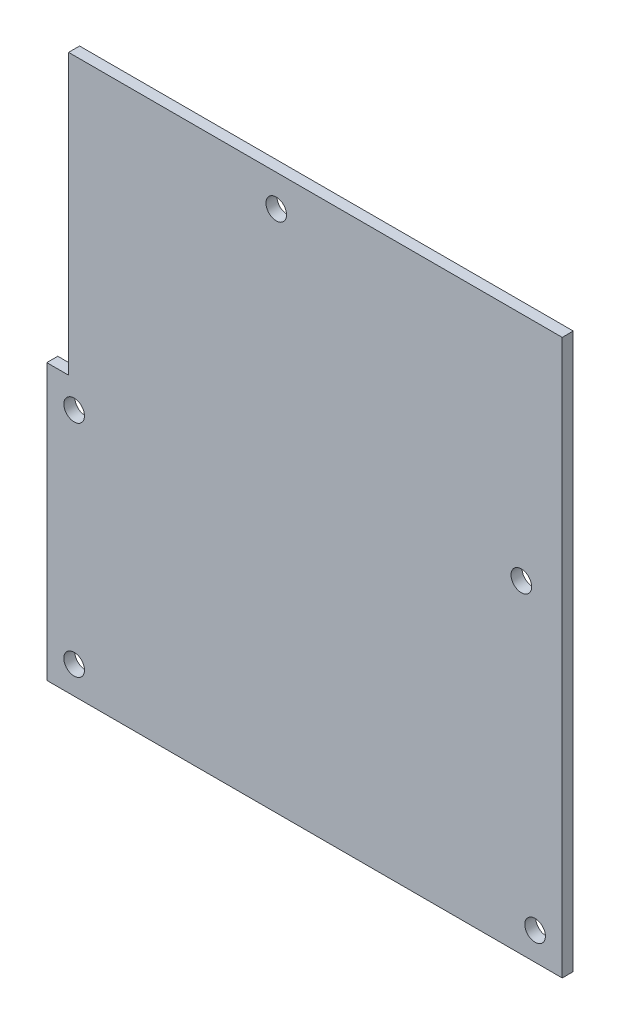
ISO-10303-21;
HEADER;
FILE_DESCRIPTION(('STEP AP214'),'2;1');
FILE_NAME('part.step','',(''),(''),'','','');
FILE_SCHEMA(('AUTOMOTIVE_DESIGN { 1 0 10303 214 1 1 1 1 }'));
ENDSEC;
DATA;
#1=APPLICATION_CONTEXT('core data for automotive mechanical design processes');
#2=APPLICATION_PROTOCOL_DEFINITION('international standard','automotive_design',2000,#1);
#3=PRODUCT_CONTEXT('',#1,'mechanical');
#4=PRODUCT('Part','Part','',(#3));
#5=PRODUCT_RELATED_PRODUCT_CATEGORY('part','',(#4));
#6=PRODUCT_DEFINITION_FORMATION('','',#4);
#7=PRODUCT_DEFINITION_CONTEXT('part definition',#1,'design');
#8=PRODUCT_DEFINITION('design','',#6,#7);
#9=PRODUCT_DEFINITION_SHAPE('','',#8);
#10=(LENGTH_UNIT() NAMED_UNIT(*) SI_UNIT(.MILLI.,.METRE.));
#11=(NAMED_UNIT(*) PLANE_ANGLE_UNIT() SI_UNIT($,.RADIAN.));
#12=(NAMED_UNIT(*) SI_UNIT($,.STERADIAN.) SOLID_ANGLE_UNIT());
#13=UNCERTAINTY_MEASURE_WITH_UNIT(LENGTH_MEASURE(1.E-05),#10,'distance_accuracy_value','');
#14=(GEOMETRIC_REPRESENTATION_CONTEXT(3) GLOBAL_UNCERTAINTY_ASSIGNED_CONTEXT((#13)) GLOBAL_UNIT_ASSIGNED_CONTEXT((#10,
#11,#12)) REPRESENTATION_CONTEXT('',''));
#15=CARTESIAN_POINT('',(0.,0.,0.));
#16=DIRECTION('',(0.,0.,1.));
#17=DIRECTION('',(1.,0.,0.));
#18=AXIS2_PLACEMENT_3D('',#15,#16,#17);
#19=CARTESIAN_POINT('',(0.,80.645,1.6002));
#20=DIRECTION('',(0.,-1.,0.));
#21=DIRECTION('',(0.,0.,-1.));
#22=AXIS2_PLACEMENT_3D('',#19,#20,#21);
#23=PLANE('',#22);
#24=DIRECTION('',(-1.,0.,0.));
#25=VECTOR('',#24,1.);
#26=CARTESIAN_POINT('',(0.,80.645,0.));
#27=LINE('',#26,#25);
#28=CARTESIAN_POINT('',(74.93,80.645,0.));
#29=VERTEX_POINT('',#28);
#30=CARTESIAN_POINT('',(3.175,80.645,0.));
#31=VERTEX_POINT('',#30);
#32=EDGE_CURVE('E132',#29,#31,#27,.T.);
#33=ORIENTED_EDGE('',*,*,#32,.T.);
#34=DIRECTION('',(0.,0.,-1.));
#35=VECTOR('',#34,1.);
#36=CARTESIAN_POINT('',(3.175,80.645,1.6002));
#37=LINE('',#36,#35);
#38=CARTESIAN_POINT('',(3.175,80.645,1.6002));
#39=VERTEX_POINT('',#38);
#40=EDGE_CURVE('E11',#39,#31,#37,.T.);
#41=ORIENTED_EDGE('',*,*,#40,.F.);
#42=DIRECTION('',(-1.,0.,0.));
#43=VECTOR('',#42,1.);
#44=CARTESIAN_POINT('',(0.,80.645,1.6002));
#45=LINE('',#44,#43);
#46=CARTESIAN_POINT('',(74.93,80.645,1.6002));
#47=VERTEX_POINT('',#46);
#48=EDGE_CURVE('E157',#47,#39,#45,.T.);
#49=ORIENTED_EDGE('',*,*,#48,.F.);
#50=DIRECTION('',(0.,0.,-1.));
#51=VECTOR('',#50,1.);
#52=CARTESIAN_POINT('',(74.93,80.645,1.6002));
#53=LINE('',#52,#51);
#54=EDGE_CURVE('E116',#47,#29,#53,.T.);
#55=ORIENTED_EDGE('',*,*,#54,.T.);
#56=EDGE_LOOP('',(#33,#41,#49,#55));
#57=FACE_BOUND('',#56,.T.);
#58=ADVANCED_FACE('F32',(#57),#23,.F.);
#59=CARTESIAN_POINT('',(3.175,0.,1.6002));
#60=DIRECTION('',(1.,0.,0.));
#61=DIRECTION('',(0.,0.,-1.));
#62=AXIS2_PLACEMENT_3D('',#59,#60,#61);
#63=PLANE('',#62);
#64=DIRECTION('',(0.,-1.,0.));
#65=VECTOR('',#64,1.);
#66=CARTESIAN_POINT('',(3.175,0.,0.));
#67=LINE('',#66,#65);
#68=CARTESIAN_POINT('',(3.175,40.005,0.));
#69=VERTEX_POINT('',#68);
#70=EDGE_CURVE('E135',#31,#69,#67,.T.);
#71=ORIENTED_EDGE('',*,*,#70,.T.);
#72=DIRECTION('',(0.,0.,-1.));
#73=VECTOR('',#72,1.);
#74=CARTESIAN_POINT('',(3.175,40.005,1.6002));
#75=LINE('',#74,#73);
#76=CARTESIAN_POINT('',(3.175,40.005,1.6002));
#77=VERTEX_POINT('',#76);
#78=EDGE_CURVE('E41',#77,#69,#75,.T.);
#79=ORIENTED_EDGE('',*,*,#78,.F.);
#80=DIRECTION('',(0.,-1.,0.));
#81=VECTOR('',#80,1.);
#82=CARTESIAN_POINT('',(3.175,0.,1.6002));
#83=LINE('',#82,#81);
#84=EDGE_CURVE('E85',#39,#77,#83,.T.);
#85=ORIENTED_EDGE('',*,*,#84,.F.);
#86=ORIENTED_EDGE('',*,*,#40,.T.);
#87=EDGE_LOOP('',(#71,#79,#85,#86));
#88=FACE_BOUND('',#87,.T.);
#89=ADVANCED_FACE('F150',(#88),#63,.F.);
#90=CARTESIAN_POINT('',(0.,40.005,1.6002));
#91=DIRECTION('',(0.,1.,0.));
#92=DIRECTION('',(0.,0.,1.));
#93=AXIS2_PLACEMENT_3D('',#90,#91,#92);
#94=PLANE('',#93);
#95=DIRECTION('',(1.,0.,0.));
#96=VECTOR('',#95,1.);
#97=CARTESIAN_POINT('',(0.,40.005,0.));
#98=LINE('',#97,#96);
#99=CARTESIAN_POINT('',(0.,40.005,0.));
#100=VERTEX_POINT('',#99);
#101=EDGE_CURVE('E138',#100,#69,#98,.T.);
#102=ORIENTED_EDGE('',*,*,#101,.F.);
#103=DIRECTION('',(0.,0.,-1.));
#104=VECTOR('',#103,1.);
#105=CARTESIAN_POINT('',(0.,40.005,1.6002));
#106=LINE('',#105,#104);
#107=CARTESIAN_POINT('',(0.,40.005,1.6002));
#108=VERTEX_POINT('',#107);
#109=EDGE_CURVE('E101',#108,#100,#106,.T.);
#110=ORIENTED_EDGE('',*,*,#109,.F.);
#111=DIRECTION('',(1.,0.,0.));
#112=VECTOR('',#111,1.);
#113=CARTESIAN_POINT('',(0.,40.005,1.6002));
#114=LINE('',#113,#112);
#115=EDGE_CURVE('E110',#108,#77,#114,.T.);
#116=ORIENTED_EDGE('',*,*,#115,.T.);
#117=ORIENTED_EDGE('',*,*,#78,.T.);
#118=EDGE_LOOP('',(#102,#110,#116,#117));
#119=FACE_BOUND('',#118,.T.);
#120=ADVANCED_FACE('F149',(#119),#94,.T.);
#121=CARTESIAN_POINT('',(0.,0.,1.6002));
#122=DIRECTION('',(-1.,0.,0.));
#123=DIRECTION('',(0.,0.,1.));
#124=AXIS2_PLACEMENT_3D('',#121,#122,#123);
#125=PLANE('',#124);
#126=DIRECTION('',(0.,1.,0.));
#127=VECTOR('',#126,1.);
#128=CARTESIAN_POINT('',(0.,0.,0.));
#129=LINE('',#128,#127);
#130=CARTESIAN_POINT('',(0.,0.,0.));
#131=VERTEX_POINT('',#130);
#132=EDGE_CURVE('E100',#131,#100,#129,.T.);
#133=ORIENTED_EDGE('',*,*,#132,.F.);
#134=DIRECTION('',(0.,0.,-1.));
#135=VECTOR('',#134,1.);
#136=CARTESIAN_POINT('',(0.,0.,1.6002));
#137=LINE('',#136,#135);
#138=CARTESIAN_POINT('',(0.,0.,1.6002));
#139=VERTEX_POINT('',#138);
#140=EDGE_CURVE('E94',#139,#131,#137,.T.);
#141=ORIENTED_EDGE('',*,*,#140,.F.);
#142=DIRECTION('',(0.,1.,0.));
#143=VECTOR('',#142,1.);
#144=CARTESIAN_POINT('',(0.,0.,1.6002));
#145=LINE('',#144,#143);
#146=EDGE_CURVE('E98',#139,#108,#145,.T.);
#147=ORIENTED_EDGE('',*,*,#146,.T.);
#148=ORIENTED_EDGE('',*,*,#109,.T.);
#149=EDGE_LOOP('',(#133,#141,#147,#148));
#150=FACE_BOUND('',#149,.T.);
#151=ADVANCED_FACE('F96',(#150),#125,.T.);
#152=CARTESIAN_POINT('',(0.,0.,1.6002));
#153=DIRECTION('',(0.,1.,0.));
#154=DIRECTION('',(0.,0.,1.));
#155=AXIS2_PLACEMENT_3D('',#152,#153,#154);
#156=PLANE('',#155);
#157=DIRECTION('',(1.,0.,0.));
#158=VECTOR('',#157,1.);
#159=CARTESIAN_POINT('',(0.,0.,0.));
#160=LINE('',#159,#158);
#161=CARTESIAN_POINT('',(74.93,0.,0.));
#162=VERTEX_POINT('',#161);
#163=EDGE_CURVE('E71',#131,#162,#160,.T.);
#164=ORIENTED_EDGE('',*,*,#163,.T.);
#165=DIRECTION('',(0.,0.,-1.));
#166=VECTOR('',#165,1.);
#167=CARTESIAN_POINT('',(74.93,0.,1.6002));
#168=LINE('',#167,#166);
#169=CARTESIAN_POINT('',(74.93,0.,1.6002));
#170=VERTEX_POINT('',#169);
#171=EDGE_CURVE('E102',#170,#162,#168,.T.);
#172=ORIENTED_EDGE('',*,*,#171,.F.);
#173=DIRECTION('',(1.,0.,0.));
#174=VECTOR('',#173,1.);
#175=CARTESIAN_POINT('',(0.,0.,1.6002));
#176=LINE('',#175,#174);
#177=EDGE_CURVE('E104',#139,#170,#176,.T.);
#178=ORIENTED_EDGE('',*,*,#177,.F.);
#179=ORIENTED_EDGE('',*,*,#140,.T.);
#180=EDGE_LOOP('',(#164,#172,#178,#179));
#181=FACE_BOUND('',#180,.T.);
#182=ADVANCED_FACE('F105',(#181),#156,.F.);
#183=CARTESIAN_POINT('',(3.984,4.026,1.6002));
#184=DIRECTION('',(0.,0.,-1.));
#185=DIRECTION('',(-1.,0.,0.));
#186=AXIS2_PLACEMENT_3D('',#183,#184,#185);
#187=CYLINDRICAL_SURFACE('',#186,1.5);
#188=CARTESIAN_POINT('',(3.984,4.026,1.6002));
#189=DIRECTION('',(0.,0.,1.));
#190=DIRECTION('',(1.,0.,0.));
#191=AXIS2_PLACEMENT_3D('',#188,#189,#190);
#192=CIRCLE('',#191,1.5);
#193=CARTESIAN_POINT('',(5.484,4.026,1.6002));
#194=VERTEX_POINT('',#193);
#195=EDGE_CURVE('E309',#194,#194,#192,.T.);
#196=ORIENTED_EDGE('',*,*,#195,.T.);
#197=EDGE_LOOP('',(#196));
#198=FACE_BOUND('',#197,.T.);
#199=CARTESIAN_POINT('',(3.984,4.026,0.));
#200=DIRECTION('',(0.,0.,1.));
#201=DIRECTION('',(1.,0.,0.));
#202=AXIS2_PLACEMENT_3D('',#199,#200,#201);
#203=CIRCLE('',#202,1.5);
#204=CARTESIAN_POINT('',(5.484,4.026,0.));
#205=VERTEX_POINT('',#204);
#206=EDGE_CURVE('E129',#205,#205,#203,.T.);
#207=ORIENTED_EDGE('',*,*,#206,.F.);
#208=EDGE_LOOP('',(#207));
#209=FACE_BOUND('',#208,.T.);
#210=ADVANCED_FACE('F179',(#198,#209),#187,.F.);
#211=CARTESIAN_POINT('',(70.984,4.026,1.6002));
#212=DIRECTION('',(0.,0.,-1.));
#213=DIRECTION('',(-1.,0.,0.));
#214=AXIS2_PLACEMENT_3D('',#211,#212,#213);
#215=CYLINDRICAL_SURFACE('',#214,1.5);
#216=CARTESIAN_POINT('',(70.984,4.026,1.6002));
#217=DIRECTION('',(0.,0.,1.));
#218=DIRECTION('',(1.,0.,0.));
#219=AXIS2_PLACEMENT_3D('',#216,#217,#218);
#220=CIRCLE('',#219,1.5);
#221=CARTESIAN_POINT('',(72.484,4.026,1.6002));
#222=VERTEX_POINT('',#221);
#223=EDGE_CURVE('E302',#222,#222,#220,.T.);
#224=ORIENTED_EDGE('',*,*,#223,.T.);
#225=EDGE_LOOP('',(#224));
#226=FACE_BOUND('',#225,.T.);
#227=CARTESIAN_POINT('',(70.984,4.026,0.));
#228=DIRECTION('',(0.,0.,1.));
#229=DIRECTION('',(1.,0.,0.));
#230=AXIS2_PLACEMENT_3D('',#227,#228,#229);
#231=CIRCLE('',#230,1.5);
#232=CARTESIAN_POINT('',(72.484,4.026,0.));
#233=VERTEX_POINT('',#232);
#234=EDGE_CURVE('E126',#233,#233,#231,.T.);
#235=ORIENTED_EDGE('',*,*,#234,.F.);
#236=EDGE_LOOP('',(#235));
#237=FACE_BOUND('',#236,.T.);
#238=ADVANCED_FACE('F182',(#226,#237),#215,.F.);
#239=CARTESIAN_POINT('',(3.984,36.026,1.6002));
#240=DIRECTION('',(0.,0.,-1.));
#241=DIRECTION('',(-1.,0.,0.));
#242=AXIS2_PLACEMENT_3D('',#239,#240,#241);
#243=CYLINDRICAL_SURFACE('',#242,1.5);
#244=CARTESIAN_POINT('',(3.984,36.026,1.6002));
#245=DIRECTION('',(0.,0.,1.));
#246=DIRECTION('',(1.,0.,0.));
#247=AXIS2_PLACEMENT_3D('',#244,#245,#246);
#248=CIRCLE('',#247,1.5);
#249=CARTESIAN_POINT('',(5.484,36.026,1.6002));
#250=VERTEX_POINT('',#249);
#251=EDGE_CURVE('E299',#250,#250,#248,.T.);
#252=ORIENTED_EDGE('',*,*,#251,.T.);
#253=EDGE_LOOP('',(#252));
#254=FACE_BOUND('',#253,.T.);
#255=CARTESIAN_POINT('',(3.984,36.026,0.));
#256=DIRECTION('',(0.,0.,1.));
#257=DIRECTION('',(1.,0.,0.));
#258=AXIS2_PLACEMENT_3D('',#255,#256,#257);
#259=CIRCLE('',#258,1.5);
#260=CARTESIAN_POINT('',(5.484,36.026,0.));
#261=VERTEX_POINT('',#260);
#262=EDGE_CURVE('E123',#261,#261,#259,.T.);
#263=ORIENTED_EDGE('',*,*,#262,.F.);
#264=EDGE_LOOP('',(#263));
#265=FACE_BOUND('',#264,.T.);
#266=ADVANCED_FACE('F186',(#254,#265),#243,.F.);
#267=CARTESIAN_POINT('',(33.3595,76.026,1.6002));
#268=DIRECTION('',(0.,0.,-1.));
#269=DIRECTION('',(-1.,0.,0.));
#270=AXIS2_PLACEMENT_3D('',#267,#268,#269);
#271=CYLINDRICAL_SURFACE('',#270,1.5);
#272=CARTESIAN_POINT('',(33.3595,76.026,1.6002));
#273=DIRECTION('',(0.,0.,1.));
#274=DIRECTION('',(1.,0.,0.));
#275=AXIS2_PLACEMENT_3D('',#272,#273,#274);
#276=CIRCLE('',#275,1.5);
#277=CARTESIAN_POINT('',(34.8595,76.026,1.6002));
#278=VERTEX_POINT('',#277);
#279=EDGE_CURVE('E197',#278,#278,#276,.T.);
#280=ORIENTED_EDGE('',*,*,#279,.T.);
#281=EDGE_LOOP('',(#280));
#282=FACE_BOUND('',#281,.T.);
#283=CARTESIAN_POINT('',(33.3595,76.026,0.));
#284=DIRECTION('',(0.,0.,1.));
#285=DIRECTION('',(1.,0.,0.));
#286=AXIS2_PLACEMENT_3D('',#283,#284,#285);
#287=CIRCLE('',#286,1.5);
#288=CARTESIAN_POINT('',(34.8595,76.026,0.));
#289=VERTEX_POINT('',#288);
#290=EDGE_CURVE('E120',#289,#289,#287,.T.);
#291=ORIENTED_EDGE('',*,*,#290,.F.);
#292=EDGE_LOOP('',(#291));
#293=FACE_BOUND('',#292,.T.);
#294=ADVANCED_FACE('F167',(#282,#293),#271,.F.);
#295=CARTESIAN_POINT('',(68.984,47.026,1.6002));
#296=DIRECTION('',(0.,0.,-1.));
#297=DIRECTION('',(-1.,0.,0.));
#298=AXIS2_PLACEMENT_3D('',#295,#296,#297);
#299=CYLINDRICAL_SURFACE('',#298,1.5);
#300=CARTESIAN_POINT('',(68.984,47.026,1.6002));
#301=DIRECTION('',(0.,0.,1.));
#302=DIRECTION('',(1.,0.,0.));
#303=AXIS2_PLACEMENT_3D('',#300,#301,#302);
#304=CIRCLE('',#303,1.5);
#305=CARTESIAN_POINT('',(70.484,47.026,1.6002));
#306=VERTEX_POINT('',#305);
#307=EDGE_CURVE('E144',#306,#306,#304,.T.);
#308=ORIENTED_EDGE('',*,*,#307,.T.);
#309=EDGE_LOOP('',(#308));
#310=FACE_BOUND('',#309,.T.);
#311=CARTESIAN_POINT('',(68.984,47.026,0.));
#312=DIRECTION('',(0.,0.,1.));
#313=DIRECTION('',(1.,0.,0.));
#314=AXIS2_PLACEMENT_3D('',#311,#312,#313);
#315=CIRCLE('',#314,1.5);
#316=CARTESIAN_POINT('',(70.484,47.026,0.));
#317=VERTEX_POINT('',#316);
#318=EDGE_CURVE('E117',#317,#317,#315,.T.);
#319=ORIENTED_EDGE('',*,*,#318,.F.);
#320=EDGE_LOOP('',(#319));
#321=FACE_BOUND('',#320,.T.);
#322=ADVANCED_FACE('F34',(#310,#321),#299,.F.);
#323=CARTESIAN_POINT('',(74.93,0.,1.6002));
#324=DIRECTION('',(-1.,0.,0.));
#325=DIRECTION('',(0.,0.,1.));
#326=AXIS2_PLACEMENT_3D('',#323,#324,#325);
#327=PLANE('',#326);
#328=DIRECTION('',(0.,1.,0.));
#329=VECTOR('',#328,1.);
#330=CARTESIAN_POINT('',(74.93,0.,0.));
#331=LINE('',#330,#329);
#332=EDGE_CURVE('E77',#162,#29,#331,.T.);
#333=ORIENTED_EDGE('',*,*,#332,.T.);
#334=ORIENTED_EDGE('',*,*,#54,.F.);
#335=DIRECTION('',(0.,1.,0.));
#336=VECTOR('',#335,1.);
#337=CARTESIAN_POINT('',(74.93,0.,1.6002));
#338=LINE('',#337,#336);
#339=EDGE_CURVE('E49',#170,#47,#338,.T.);
#340=ORIENTED_EDGE('',*,*,#339,.F.);
#341=ORIENTED_EDGE('',*,*,#171,.T.);
#342=EDGE_LOOP('',(#333,#334,#340,#341));
#343=FACE_BOUND('',#342,.T.);
#344=ADVANCED_FACE('F158',(#343),#327,.F.);
#345=CARTESIAN_POINT('',(0.,0.,1.6002));
#346=DIRECTION('',(0.,0.,1.));
#347=DIRECTION('',(1.,0.,0.));
#348=AXIS2_PLACEMENT_3D('',#345,#346,#347);
#349=PLANE('',#348);
#350=ORIENTED_EDGE('',*,*,#307,.F.);
#351=EDGE_LOOP('',(#350));
#352=FACE_BOUND('',#351,.T.);
#353=ORIENTED_EDGE('',*,*,#279,.F.);
#354=EDGE_LOOP('',(#353));
#355=FACE_BOUND('',#354,.T.);
#356=ORIENTED_EDGE('',*,*,#251,.F.);
#357=EDGE_LOOP('',(#356));
#358=FACE_BOUND('',#357,.T.);
#359=ORIENTED_EDGE('',*,*,#223,.F.);
#360=EDGE_LOOP('',(#359));
#361=FACE_BOUND('',#360,.T.);
#362=ORIENTED_EDGE('',*,*,#195,.F.);
#363=EDGE_LOOP('',(#362));
#364=FACE_BOUND('',#363,.T.);
#365=ORIENTED_EDGE('',*,*,#48,.T.);
#366=ORIENTED_EDGE('',*,*,#84,.T.);
#367=ORIENTED_EDGE('',*,*,#115,.F.);
#368=ORIENTED_EDGE('',*,*,#146,.F.);
#369=ORIENTED_EDGE('',*,*,#177,.T.);
#370=ORIENTED_EDGE('',*,*,#339,.T.);
#371=EDGE_LOOP('',(#365,#366,#367,#368,#369,#370));
#372=FACE_BOUND('',#371,.T.);
#373=ADVANCED_FACE('F108',(#352,#355,#358,#361,#364,#372),#349,.T.);
#374=CARTESIAN_POINT('',(0.,0.,0.));
#375=DIRECTION('',(0.,0.,1.));
#376=DIRECTION('',(1.,0.,0.));
#377=AXIS2_PLACEMENT_3D('',#374,#375,#376);
#378=PLANE('',#377);
#379=ORIENTED_EDGE('',*,*,#318,.T.);
#380=EDGE_LOOP('',(#379));
#381=FACE_BOUND('',#380,.T.);
#382=ORIENTED_EDGE('',*,*,#290,.T.);
#383=EDGE_LOOP('',(#382));
#384=FACE_BOUND('',#383,.T.);
#385=ORIENTED_EDGE('',*,*,#262,.T.);
#386=EDGE_LOOP('',(#385));
#387=FACE_BOUND('',#386,.T.);
#388=ORIENTED_EDGE('',*,*,#234,.T.);
#389=EDGE_LOOP('',(#388));
#390=FACE_BOUND('',#389,.T.);
#391=ORIENTED_EDGE('',*,*,#206,.T.);
#392=EDGE_LOOP('',(#391));
#393=FACE_BOUND('',#392,.T.);
#394=ORIENTED_EDGE('',*,*,#32,.F.);
#395=ORIENTED_EDGE('',*,*,#332,.F.);
#396=ORIENTED_EDGE('',*,*,#163,.F.);
#397=ORIENTED_EDGE('',*,*,#132,.T.);
#398=ORIENTED_EDGE('',*,*,#101,.T.);
#399=ORIENTED_EDGE('',*,*,#70,.F.);
#400=EDGE_LOOP('',(#394,#395,#396,#397,#398,#399));
#401=FACE_BOUND('',#400,.T.);
#402=ADVANCED_FACE('F154',(#381,#384,#387,#390,#393,#401),#378,.F.);
#403=CLOSED_SHELL('',(#58,#89,#120,#151,#182,#210,#238,#266,#294,#322,#344,#373,#402));
#404=MANIFOLD_SOLID_BREP('B2',#403);
#405=ADVANCED_BREP_SHAPE_REPRESENTATION('',(#18,#404),#14);
#406=SHAPE_DEFINITION_REPRESENTATION(#9,#405);
ENDSEC;
END-ISO-10303-21;
